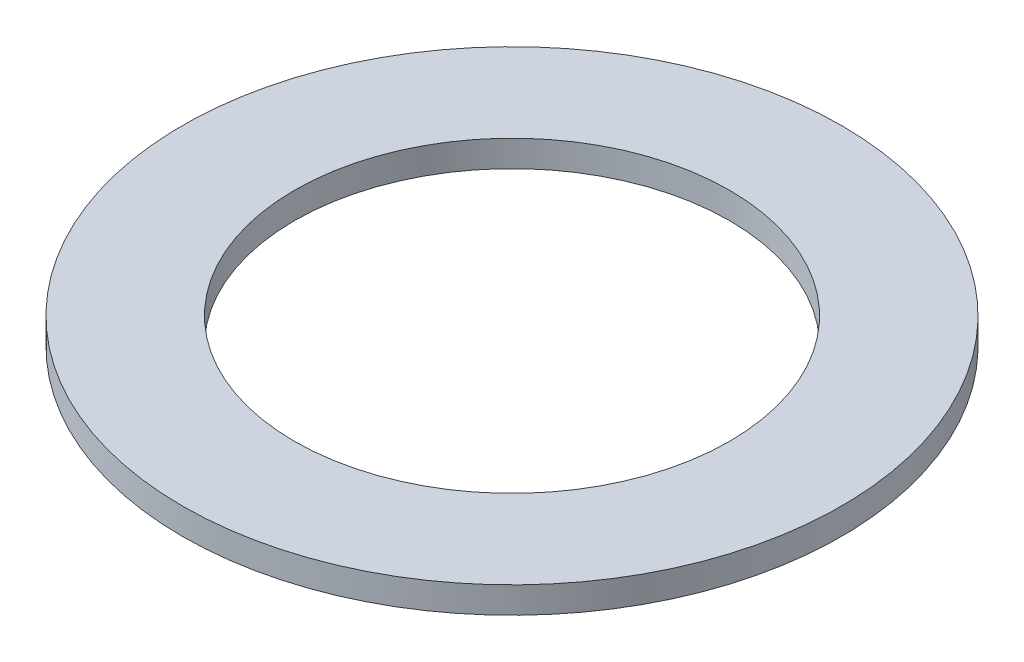
ISO-10303-21;
HEADER;
FILE_DESCRIPTION(('STEP AP214'),'2;1');
FILE_NAME('part.step','',(''),(''),'','','');
FILE_SCHEMA(('AUTOMOTIVE_DESIGN { 1 0 10303 214 1 1 1 1 }'));
ENDSEC;
DATA;
#1=APPLICATION_CONTEXT('core data for automotive mechanical design processes');
#2=APPLICATION_PROTOCOL_DEFINITION('international standard','automotive_design',2000,#1);
#3=PRODUCT_CONTEXT('',#1,'mechanical');
#4=PRODUCT('Part','Part','',(#3));
#5=PRODUCT_RELATED_PRODUCT_CATEGORY('part','',(#4));
#6=PRODUCT_DEFINITION_FORMATION('','',#4);
#7=PRODUCT_DEFINITION_CONTEXT('part definition',#1,'design');
#8=PRODUCT_DEFINITION('design','',#6,#7);
#9=PRODUCT_DEFINITION_SHAPE('','',#8);
#10=(LENGTH_UNIT() NAMED_UNIT(*) SI_UNIT(.MILLI.,.METRE.));
#11=(NAMED_UNIT(*) PLANE_ANGLE_UNIT() SI_UNIT($,.RADIAN.));
#12=(NAMED_UNIT(*) SI_UNIT($,.STERADIAN.) SOLID_ANGLE_UNIT());
#13=UNCERTAINTY_MEASURE_WITH_UNIT(LENGTH_MEASURE(1.E-05),#10,'distance_accuracy_value','');
#14=(GEOMETRIC_REPRESENTATION_CONTEXT(3) GLOBAL_UNCERTAINTY_ASSIGNED_CONTEXT((#13)) GLOBAL_UNIT_ASSIGNED_CONTEXT((#10,
#11,#12)) REPRESENTATION_CONTEXT('',''));
#15=CARTESIAN_POINT('',(0.,0.,0.));
#16=DIRECTION('',(0.,0.,1.));
#17=DIRECTION('',(1.,0.,0.));
#18=AXIS2_PLACEMENT_3D('',#15,#16,#17);
#19=CARTESIAN_POINT('',(-6.31792084466018,0.4,-15.1140953737864));
#20=DIRECTION('',(0.,1.,0.));
#21=DIRECTION('',(0.,0.,1.));
#22=AXIS2_PLACEMENT_3D('',#19,#20,#21);
#23=PLANE('',#22);
#24=CARTESIAN_POINT('',(-6.31792084466018,0.4,-15.1140953737864));
#25=DIRECTION('',(0.,1.,0.));
#26=DIRECTION('',(0.,0.,1.));
#27=AXIS2_PLACEMENT_3D('',#24,#25,#26);
#28=CIRCLE('',#27,5.);
#29=CARTESIAN_POINT('',(-6.31792084466018,0.4,-10.1140953737864));
#30=VERTEX_POINT('',#29);
#31=EDGE_CURVE('E10',#30,#30,#28,.T.);
#32=ORIENTED_EDGE('',*,*,#31,.T.);
#33=EDGE_LOOP('',(#32));
#34=FACE_BOUND('',#33,.T.);
#35=CARTESIAN_POINT('',(-6.31792084466018,0.4,-15.1140953737864));
#36=DIRECTION('',(0.,1.,0.));
#37=DIRECTION('',(0.,0.,1.));
#38=AXIS2_PLACEMENT_3D('',#35,#36,#37);
#39=CIRCLE('',#38,3.3);
#40=CARTESIAN_POINT('',(-6.31792084466018,0.4,-11.8140953737864));
#41=VERTEX_POINT('',#40);
#42=EDGE_CURVE('E54',#41,#41,#39,.T.);
#43=ORIENTED_EDGE('',*,*,#42,.F.);
#44=EDGE_LOOP('',(#43));
#45=FACE_BOUND('',#44,.T.);
#46=ADVANCED_FACE('F41',(#34,#45),#23,.T.);
#47=CARTESIAN_POINT('',(-6.31792084466018,0.,-15.1140953737864));
#48=DIRECTION('',(0.,1.,0.));
#49=DIRECTION('',(0.,0.,1.));
#50=AXIS2_PLACEMENT_3D('',#47,#48,#49);
#51=PLANE('',#50);
#52=CARTESIAN_POINT('',(-6.31792084466018,0.,-15.1140953737864));
#53=DIRECTION('',(0.,1.,0.));
#54=DIRECTION('',(0.,0.,1.));
#55=AXIS2_PLACEMENT_3D('',#52,#53,#54);
#56=CIRCLE('',#55,5.);
#57=CARTESIAN_POINT('',(-6.31792084466018,0.,-10.1140953737864));
#58=VERTEX_POINT('',#57);
#59=EDGE_CURVE('E45',#58,#58,#56,.T.);
#60=ORIENTED_EDGE('',*,*,#59,.F.);
#61=EDGE_LOOP('',(#60));
#62=FACE_BOUND('',#61,.T.);
#63=CARTESIAN_POINT('',(-6.31792084466018,0.,-15.1140953737864));
#64=DIRECTION('',(0.,1.,0.));
#65=DIRECTION('',(0.,0.,1.));
#66=AXIS2_PLACEMENT_3D('',#63,#64,#65);
#67=CIRCLE('',#66,3.3);
#68=CARTESIAN_POINT('',(-6.31792084466018,0.,-11.8140953737864));
#69=VERTEX_POINT('',#68);
#70=EDGE_CURVE('E56',#69,#69,#67,.T.);
#71=ORIENTED_EDGE('',*,*,#70,.T.);
#72=EDGE_LOOP('',(#71));
#73=FACE_BOUND('',#72,.T.);
#74=ADVANCED_FACE('F68',(#62,#73),#51,.F.);
#75=CARTESIAN_POINT('',(-6.31792084466018,0.4,-15.1140953737864));
#76=DIRECTION('',(0.,-1.,0.));
#77=DIRECTION('',(0.,0.,-1.));
#78=AXIS2_PLACEMENT_3D('',#75,#76,#77);
#79=CYLINDRICAL_SURFACE('',#78,5.);
#80=ORIENTED_EDGE('',*,*,#31,.F.);
#81=EDGE_LOOP('',(#80));
#82=FACE_BOUND('',#81,.T.);
#83=ORIENTED_EDGE('',*,*,#59,.T.);
#84=EDGE_LOOP('',(#83));
#85=FACE_BOUND('',#84,.T.);
#86=ADVANCED_FACE('F43',(#82,#85),#79,.T.);
#87=CARTESIAN_POINT('',(-6.31792084466018,0.4,-15.1140953737864));
#88=DIRECTION('',(0.,-1.,0.));
#89=DIRECTION('',(0.,0.,-1.));
#90=AXIS2_PLACEMENT_3D('',#87,#88,#89);
#91=CYLINDRICAL_SURFACE('',#90,3.3);
#92=ORIENTED_EDGE('',*,*,#42,.T.);
#93=EDGE_LOOP('',(#92));
#94=FACE_BOUND('',#93,.T.);
#95=ORIENTED_EDGE('',*,*,#70,.F.);
#96=EDGE_LOOP('',(#95));
#97=FACE_BOUND('',#96,.T.);
#98=ADVANCED_FACE('F64',(#94,#97),#91,.F.);
#99=CLOSED_SHELL('',(#46,#74,#86,#98));
#100=MANIFOLD_SOLID_BREP('B2',#99);
#101=ADVANCED_BREP_SHAPE_REPRESENTATION('',(#18,#100),#14);
#102=SHAPE_DEFINITION_REPRESENTATION(#9,#101);
ENDSEC;
END-ISO-10303-21;
